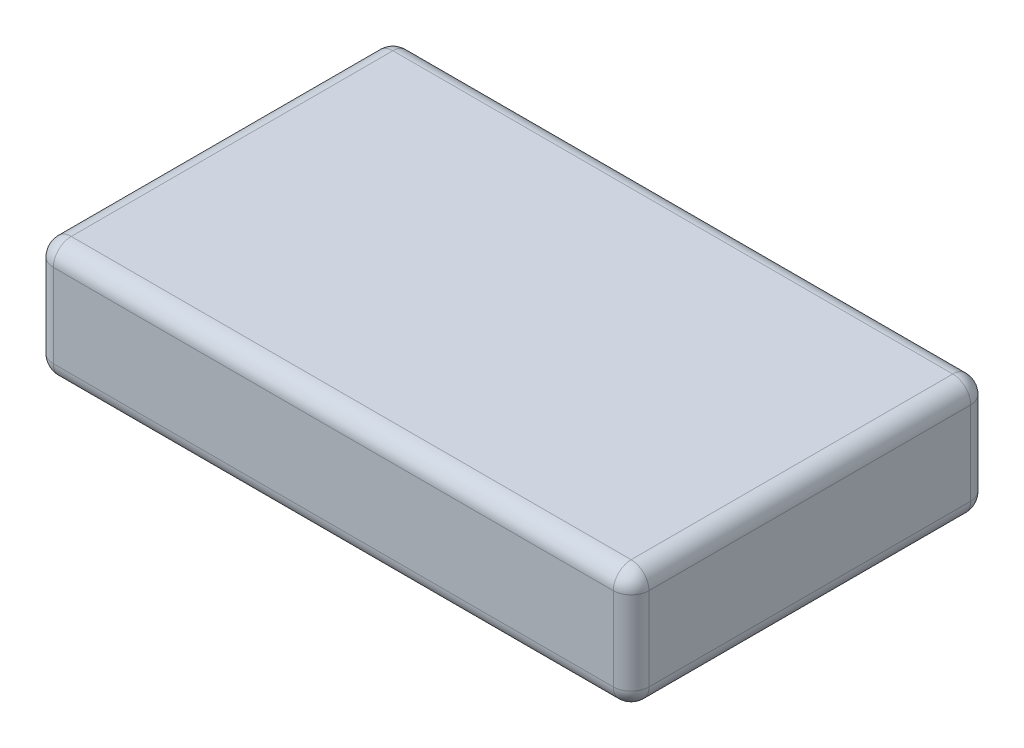
ISO-10303-21;
HEADER;
FILE_DESCRIPTION(('STEP AP214'),'2;1');
FILE_NAME('part.step','',(''),(''),'','','');
FILE_SCHEMA(('AUTOMOTIVE_DESIGN { 1 0 10303 214 1 1 1 1 }'));
ENDSEC;
DATA;
#1=APPLICATION_CONTEXT('core data for automotive mechanical design processes');
#2=APPLICATION_PROTOCOL_DEFINITION('international standard','automotive_design',2000,#1);
#3=PRODUCT_CONTEXT('',#1,'mechanical');
#4=PRODUCT('Part','Part','',(#3));
#5=PRODUCT_RELATED_PRODUCT_CATEGORY('part','',(#4));
#6=PRODUCT_DEFINITION_FORMATION('','',#4);
#7=PRODUCT_DEFINITION_CONTEXT('part definition',#1,'design');
#8=PRODUCT_DEFINITION('design','',#6,#7);
#9=PRODUCT_DEFINITION_SHAPE('','',#8);
#10=(LENGTH_UNIT() NAMED_UNIT(*) SI_UNIT(.MILLI.,.METRE.));
#11=(NAMED_UNIT(*) PLANE_ANGLE_UNIT() SI_UNIT($,.RADIAN.));
#12=(NAMED_UNIT(*) SI_UNIT($,.STERADIAN.) SOLID_ANGLE_UNIT());
#13=UNCERTAINTY_MEASURE_WITH_UNIT(LENGTH_MEASURE(1.E-05),#10,'distance_accuracy_value','');
#14=(GEOMETRIC_REPRESENTATION_CONTEXT(3) GLOBAL_UNCERTAINTY_ASSIGNED_CONTEXT((#13)) GLOBAL_UNIT_ASSIGNED_CONTEXT((#10,
#11,#12)) REPRESENTATION_CONTEXT('',''));
#15=CARTESIAN_POINT('',(0.,0.,0.));
#16=DIRECTION('',(0.,0.,1.));
#17=DIRECTION('',(1.,0.,0.));
#18=AXIS2_PLACEMENT_3D('',#15,#16,#17);
#19=CARTESIAN_POINT('',(50.,20.,-30.));
#20=DIRECTION('',(-1.,0.,0.));
#21=DIRECTION('',(0.,0.,1.));
#22=AXIS2_PLACEMENT_3D('',#19,#20,#21);
#23=PLANE('',#22);
#24=DIRECTION('',(0.,0.,-1.));
#25=VECTOR('',#24,1.);
#26=CARTESIAN_POINT('',(50.,17.,30.));
#27=LINE('',#26,#25);
#28=CARTESIAN_POINT('',(50.,17.,-27.));
#29=VERTEX_POINT('',#28);
#30=CARTESIAN_POINT('',(50.,17.,27.));
#31=VERTEX_POINT('',#30);
#32=EDGE_CURVE('E226',#29,#31,#27,.F.);
#33=ORIENTED_EDGE('',*,*,#32,.T.);
#34=DIRECTION('',(0.,-1.,0.));
#35=VECTOR('',#34,1.);
#36=CARTESIAN_POINT('',(50.,20.,27.));
#37=LINE('',#36,#35);
#38=CARTESIAN_POINT('',(50.,3.,27.));
#39=VERTEX_POINT('',#38);
#40=EDGE_CURVE('E225',#31,#39,#37,.T.);
#41=ORIENTED_EDGE('',*,*,#40,.T.);
#42=DIRECTION('',(0.,0.,-1.));
#43=VECTOR('',#42,1.);
#44=CARTESIAN_POINT('',(50.,3.,-30.));
#45=LINE('',#44,#43);
#46=CARTESIAN_POINT('',(50.,3.,-27.));
#47=VERTEX_POINT('',#46);
#48=EDGE_CURVE('E221',#39,#47,#45,.T.);
#49=ORIENTED_EDGE('',*,*,#48,.T.);
#50=DIRECTION('',(0.,-1.,0.));
#51=VECTOR('',#50,1.);
#52=CARTESIAN_POINT('',(50.,20.,-27.));
#53=LINE('',#52,#51);
#54=EDGE_CURVE('E230',#47,#29,#53,.F.);
#55=ORIENTED_EDGE('',*,*,#54,.T.);
#56=EDGE_LOOP('',(#33,#41,#49,#55));
#57=FACE_BOUND('',#56,.T.);
#58=ADVANCED_FACE('F35',(#57),#23,.F.);
#59=CARTESIAN_POINT('',(-50.,20.,-30.));
#60=DIRECTION('',(0.,0.,1.));
#61=DIRECTION('',(1.,0.,0.));
#62=AXIS2_PLACEMENT_3D('',#59,#60,#61);
#63=PLANE('',#62);
#64=DIRECTION('',(-1.,0.,0.));
#65=VECTOR('',#64,1.);
#66=CARTESIAN_POINT('',(50.,17.,-30.));
#67=LINE('',#66,#65);
#68=CARTESIAN_POINT('',(-47.,17.,-30.));
#69=VERTEX_POINT('',#68);
#70=CARTESIAN_POINT('',(47.,17.,-30.));
#71=VERTEX_POINT('',#70);
#72=EDGE_CURVE('E262',#69,#71,#67,.F.);
#73=ORIENTED_EDGE('',*,*,#72,.T.);
#74=DIRECTION('',(0.,-1.,0.));
#75=VECTOR('',#74,1.);
#76=CARTESIAN_POINT('',(47.,20.,-30.));
#77=LINE('',#76,#75);
#78=CARTESIAN_POINT('',(47.,3.,-30.));
#79=VERTEX_POINT('',#78);
#80=EDGE_CURVE('E256',#71,#79,#77,.T.);
#81=ORIENTED_EDGE('',*,*,#80,.T.);
#82=DIRECTION('',(-1.,0.,0.));
#83=VECTOR('',#82,1.);
#84=CARTESIAN_POINT('',(-50.,3.,-30.));
#85=LINE('',#84,#83);
#86=CARTESIAN_POINT('',(-47.,3.,-30.));
#87=VERTEX_POINT('',#86);
#88=EDGE_CURVE('E269',#79,#87,#85,.T.);
#89=ORIENTED_EDGE('',*,*,#88,.T.);
#90=DIRECTION('',(0.,-1.,0.));
#91=VECTOR('',#90,1.);
#92=CARTESIAN_POINT('',(-47.,20.,-30.));
#93=LINE('',#92,#91);
#94=EDGE_CURVE('E267',#87,#69,#93,.F.);
#95=ORIENTED_EDGE('',*,*,#94,.T.);
#96=EDGE_LOOP('',(#73,#81,#89,#95));
#97=FACE_BOUND('',#96,.T.);
#98=ADVANCED_FACE('F265',(#97),#63,.F.);
#99=CARTESIAN_POINT('',(-50.,20.,-30.));
#100=DIRECTION('',(1.,0.,0.));
#101=DIRECTION('',(0.,0.,-1.));
#102=AXIS2_PLACEMENT_3D('',#99,#100,#101);
#103=PLANE('',#102);
#104=DIRECTION('',(0.,0.,1.));
#105=VECTOR('',#104,1.);
#106=CARTESIAN_POINT('',(-50.,17.,-30.));
#107=LINE('',#106,#105);
#108=CARTESIAN_POINT('',(-50.,17.,27.));
#109=VERTEX_POINT('',#108);
#110=CARTESIAN_POINT('',(-50.,17.,-27.));
#111=VERTEX_POINT('',#110);
#112=EDGE_CURVE('E44',#109,#111,#107,.F.);
#113=ORIENTED_EDGE('',*,*,#112,.T.);
#114=DIRECTION('',(0.,-1.,0.));
#115=VECTOR('',#114,1.);
#116=CARTESIAN_POINT('',(-50.,20.,-27.));
#117=LINE('',#116,#115);
#118=CARTESIAN_POINT('',(-50.,3.,-27.));
#119=VERTEX_POINT('',#118);
#120=EDGE_CURVE('E11',#111,#119,#117,.T.);
#121=ORIENTED_EDGE('',*,*,#120,.T.);
#122=DIRECTION('',(0.,0.,1.));
#123=VECTOR('',#122,1.);
#124=CARTESIAN_POINT('',(-50.,3.,-30.));
#125=LINE('',#124,#123);
#126=CARTESIAN_POINT('',(-50.,3.,27.));
#127=VERTEX_POINT('',#126);
#128=EDGE_CURVE('E235',#119,#127,#125,.T.);
#129=ORIENTED_EDGE('',*,*,#128,.T.);
#130=DIRECTION('',(0.,-1.,0.));
#131=VECTOR('',#130,1.);
#132=CARTESIAN_POINT('',(-50.,20.,27.));
#133=LINE('',#132,#131);
#134=EDGE_CURVE('E228',#127,#109,#133,.F.);
#135=ORIENTED_EDGE('',*,*,#134,.T.);
#136=EDGE_LOOP('',(#113,#121,#129,#135));
#137=FACE_BOUND('',#136,.T.);
#138=ADVANCED_FACE('F317',(#137),#103,.F.);
#139=CARTESIAN_POINT('',(-50.,20.,30.));
#140=DIRECTION('',(0.,0.,-1.));
#141=DIRECTION('',(-1.,0.,0.));
#142=AXIS2_PLACEMENT_3D('',#139,#140,#141);
#143=PLANE('',#142);
#144=DIRECTION('',(0.,-1.,0.));
#145=VECTOR('',#144,1.);
#146=CARTESIAN_POINT('',(-47.,20.,30.));
#147=LINE('',#146,#145);
#148=CARTESIAN_POINT('',(-47.,17.,30.));
#149=VERTEX_POINT('',#148);
#150=CARTESIAN_POINT('',(-47.,3.,30.));
#151=VERTEX_POINT('',#150);
#152=EDGE_CURVE('E261',#149,#151,#147,.T.);
#153=ORIENTED_EDGE('',*,*,#152,.T.);
#154=DIRECTION('',(1.,0.,0.));
#155=VECTOR('',#154,1.);
#156=CARTESIAN_POINT('',(-50.,3.,30.));
#157=LINE('',#156,#155);
#158=CARTESIAN_POINT('',(47.,3.,30.));
#159=VERTEX_POINT('',#158);
#160=EDGE_CURVE('E279',#151,#159,#157,.T.);
#161=ORIENTED_EDGE('',*,*,#160,.T.);
#162=DIRECTION('',(0.,-1.,0.));
#163=VECTOR('',#162,1.);
#164=CARTESIAN_POINT('',(47.,20.,30.));
#165=LINE('',#164,#163);
#166=CARTESIAN_POINT('',(47.,17.,30.));
#167=VERTEX_POINT('',#166);
#168=EDGE_CURVE('E277',#159,#167,#165,.F.);
#169=ORIENTED_EDGE('',*,*,#168,.T.);
#170=DIRECTION('',(1.,0.,0.));
#171=VECTOR('',#170,1.);
#172=CARTESIAN_POINT('',(-50.,17.,30.));
#173=LINE('',#172,#171);
#174=EDGE_CURVE('E275',#167,#149,#173,.F.);
#175=ORIENTED_EDGE('',*,*,#174,.T.);
#176=EDGE_LOOP('',(#153,#161,#169,#175));
#177=FACE_BOUND('',#176,.T.);
#178=ADVANCED_FACE('F299',(#177),#143,.F.);
#179=CARTESIAN_POINT('',(0.,20.,0.));
#180=DIRECTION('',(0.,1.,0.));
#181=DIRECTION('',(0.,0.,1.));
#182=AXIS2_PLACEMENT_3D('',#179,#180,#181);
#183=PLANE('',#182);
#184=DIRECTION('',(0.,0.,-1.));
#185=VECTOR('',#184,1.);
#186=CARTESIAN_POINT('',(47.,20.,-30.));
#187=LINE('',#186,#185);
#188=CARTESIAN_POINT('',(47.,20.,27.));
#189=VERTEX_POINT('',#188);
#190=CARTESIAN_POINT('',(47.,20.,-27.));
#191=VERTEX_POINT('',#190);
#192=EDGE_CURVE('E136',#189,#191,#187,.T.);
#193=ORIENTED_EDGE('',*,*,#192,.T.);
#194=DIRECTION('',(-1.,0.,0.));
#195=VECTOR('',#194,1.);
#196=CARTESIAN_POINT('',(-50.,20.,-27.));
#197=LINE('',#196,#195);
#198=CARTESIAN_POINT('',(-47.,20.,-27.));
#199=VERTEX_POINT('',#198);
#200=EDGE_CURVE('E133',#191,#199,#197,.T.);
#201=ORIENTED_EDGE('',*,*,#200,.T.);
#202=DIRECTION('',(0.,0.,1.));
#203=VECTOR('',#202,1.);
#204=CARTESIAN_POINT('',(-47.,20.,30.));
#205=LINE('',#204,#203);
#206=CARTESIAN_POINT('',(-47.,20.,27.));
#207=VERTEX_POINT('',#206);
#208=EDGE_CURVE('E127',#199,#207,#205,.T.);
#209=ORIENTED_EDGE('',*,*,#208,.T.);
#210=DIRECTION('',(1.,0.,0.));
#211=VECTOR('',#210,1.);
#212=CARTESIAN_POINT('',(50.,20.,27.));
#213=LINE('',#212,#211);
#214=EDGE_CURVE('E130',#207,#189,#213,.T.);
#215=ORIENTED_EDGE('',*,*,#214,.T.);
#216=EDGE_LOOP('',(#193,#201,#209,#215));
#217=FACE_BOUND('',#216,.T.);
#218=ADVANCED_FACE('F129',(#217),#183,.T.);
#219=CARTESIAN_POINT('',(0.,0.,0.));
#220=DIRECTION('',(0.,1.,0.));
#221=DIRECTION('',(0.,0.,1.));
#222=AXIS2_PLACEMENT_3D('',#219,#220,#221);
#223=PLANE('',#222);
#224=DIRECTION('',(0.,0.,-1.));
#225=VECTOR('',#224,1.);
#226=CARTESIAN_POINT('',(47.,0.,0.));
#227=LINE('',#226,#225);
#228=CARTESIAN_POINT('',(47.,0.,-27.));
#229=VERTEX_POINT('',#228);
#230=CARTESIAN_POINT('',(47.,0.,27.));
#231=VERTEX_POINT('',#230);
#232=EDGE_CURVE('E219',#229,#231,#227,.F.);
#233=ORIENTED_EDGE('',*,*,#232,.T.);
#234=DIRECTION('',(1.,0.,0.));
#235=VECTOR('',#234,1.);
#236=CARTESIAN_POINT('',(0.,0.,27.));
#237=LINE('',#236,#235);
#238=CARTESIAN_POINT('',(-47.,0.,27.));
#239=VERTEX_POINT('',#238);
#240=EDGE_CURVE('E286',#231,#239,#237,.F.);
#241=ORIENTED_EDGE('',*,*,#240,.T.);
#242=DIRECTION('',(0.,0.,1.));
#243=VECTOR('',#242,1.);
#244=CARTESIAN_POINT('',(-47.,0.,0.));
#245=LINE('',#244,#243);
#246=CARTESIAN_POINT('',(-47.,0.,-27.));
#247=VERTEX_POINT('',#246);
#248=EDGE_CURVE('E284',#239,#247,#245,.F.);
#249=ORIENTED_EDGE('',*,*,#248,.T.);
#250=DIRECTION('',(-1.,0.,0.));
#251=VECTOR('',#250,1.);
#252=CARTESIAN_POINT('',(0.,0.,-27.));
#253=LINE('',#252,#251);
#254=EDGE_CURVE('E282',#247,#229,#253,.F.);
#255=ORIENTED_EDGE('',*,*,#254,.T.);
#256=EDGE_LOOP('',(#233,#241,#249,#255));
#257=FACE_BOUND('',#256,.T.);
#258=ADVANCED_FACE('F302',(#257),#223,.F.);
#259=CARTESIAN_POINT('',(-50.,3.,27.));
#260=DIRECTION('',(1.,0.,0.));
#261=DIRECTION('',(0.,0.,-1.));
#262=AXIS2_PLACEMENT_3D('',#259,#260,#261);
#263=CYLINDRICAL_SURFACE('',#262,3.);
#264=CARTESIAN_POINT('',(47.,3.,27.));
#265=DIRECTION('',(1.,0.,0.));
#266=DIRECTION('',(0.,0.,-1.));
#267=AXIS2_PLACEMENT_3D('',#264,#265,#266);
#268=CIRCLE('',#267,3.);
#269=EDGE_CURVE('E39',#159,#231,#268,.T.);
#270=ORIENTED_EDGE('',*,*,#269,.F.);
#271=ORIENTED_EDGE('',*,*,#160,.F.);
#272=CARTESIAN_POINT('',(-47.,3.,27.));
#273=DIRECTION('',(-1.,0.,0.));
#274=DIRECTION('',(0.,0.,1.));
#275=AXIS2_PLACEMENT_3D('',#272,#273,#274);
#276=CIRCLE('',#275,3.);
#277=EDGE_CURVE('E199',#239,#151,#276,.T.);
#278=ORIENTED_EDGE('',*,*,#277,.F.);
#279=ORIENTED_EDGE('',*,*,#240,.F.);
#280=EDGE_LOOP('',(#270,#271,#278,#279));
#281=FACE_BOUND('',#280,.T.);
#282=ADVANCED_FACE('F37',(#281),#263,.T.);
#283=CARTESIAN_POINT('',(47.,3.,27.));
#284=DIRECTION('',(0.,-1.,0.));
#285=DIRECTION('',(0.,0.,-1.));
#286=AXIS2_PLACEMENT_3D('',#283,#284,#285);
#287=SPHERICAL_SURFACE('',#286,3.);
#288=CARTESIAN_POINT('',(47.,3.,27.));
#289=DIRECTION('',(0.,-1.,0.));
#290=DIRECTION('',(0.,0.,-1.));
#291=AXIS2_PLACEMENT_3D('',#288,#289,#290);
#292=CIRCLE('',#291,3.);
#293=EDGE_CURVE('E194',#159,#39,#292,.F.);
#294=ORIENTED_EDGE('',*,*,#293,.F.);
#295=ORIENTED_EDGE('',*,*,#269,.T.);
#296=CARTESIAN_POINT('',(47.,3.,27.));
#297=DIRECTION('',(0.,0.,1.));
#298=DIRECTION('',(1.,0.,0.));
#299=AXIS2_PLACEMENT_3D('',#296,#297,#298);
#300=CIRCLE('',#299,3.);
#301=EDGE_CURVE('E197',#39,#231,#300,.F.);
#302=ORIENTED_EDGE('',*,*,#301,.F.);
#303=EDGE_LOOP('',(#294,#295,#302));
#304=FACE_BOUND('',#303,.T.);
#305=ADVANCED_FACE('F210',(#304),#287,.T.);
#306=CARTESIAN_POINT('',(-47.,3.,27.));
#307=DIRECTION('',(0.,0.,1.));
#308=DIRECTION('',(0.,-1.,0.));
#309=AXIS2_PLACEMENT_3D('',#306,#307,#308);
#310=SPHERICAL_SURFACE('',#309,3.);
#311=CARTESIAN_POINT('',(-47.,3.,27.));
#312=DIRECTION('',(0.,0.,1.));
#313=DIRECTION('',(1.,0.,0.));
#314=AXIS2_PLACEMENT_3D('',#311,#312,#313);
#315=CIRCLE('',#314,3.);
#316=EDGE_CURVE('E188',#239,#127,#315,.F.);
#317=ORIENTED_EDGE('',*,*,#316,.F.);
#318=ORIENTED_EDGE('',*,*,#277,.T.);
#319=CARTESIAN_POINT('',(-47.,3.,27.));
#320=DIRECTION('',(0.,-1.,0.));
#321=DIRECTION('',(0.,0.,-1.));
#322=AXIS2_PLACEMENT_3D('',#319,#320,#321);
#323=CIRCLE('',#322,3.);
#324=EDGE_CURVE('E191',#127,#151,#323,.F.);
#325=ORIENTED_EDGE('',*,*,#324,.F.);
#326=EDGE_LOOP('',(#317,#318,#325));
#327=FACE_BOUND('',#326,.T.);
#328=ADVANCED_FACE('F321',(#327),#310,.T.);
#329=CARTESIAN_POINT('',(47.,3.,-30.));
#330=DIRECTION('',(0.,0.,-1.));
#331=DIRECTION('',(-1.,0.,0.));
#332=AXIS2_PLACEMENT_3D('',#329,#330,#331);
#333=CYLINDRICAL_SURFACE('',#332,3.);
#334=ORIENTED_EDGE('',*,*,#301,.T.);
#335=ORIENTED_EDGE('',*,*,#232,.F.);
#336=CARTESIAN_POINT('',(47.,3.,-27.));
#337=DIRECTION('',(0.,0.,-1.));
#338=DIRECTION('',(-1.,0.,0.));
#339=AXIS2_PLACEMENT_3D('',#336,#337,#338);
#340=CIRCLE('',#339,3.);
#341=EDGE_CURVE('E182',#47,#229,#340,.T.);
#342=ORIENTED_EDGE('',*,*,#341,.F.);
#343=ORIENTED_EDGE('',*,*,#48,.F.);
#344=EDGE_LOOP('',(#334,#335,#342,#343));
#345=FACE_BOUND('',#344,.T.);
#346=ADVANCED_FACE('F217',(#345),#333,.T.);
#347=CARTESIAN_POINT('',(47.,20.,27.));
#348=DIRECTION('',(0.,-1.,0.));
#349=DIRECTION('',(0.,0.,-1.));
#350=AXIS2_PLACEMENT_3D('',#347,#348,#349);
#351=CYLINDRICAL_SURFACE('',#350,3.);
#352=ORIENTED_EDGE('',*,*,#293,.T.);
#353=ORIENTED_EDGE('',*,*,#40,.F.);
#354=CARTESIAN_POINT('',(47.,17.,27.));
#355=DIRECTION('',(0.,1.,0.));
#356=DIRECTION('',(0.,0.,1.));
#357=AXIS2_PLACEMENT_3D('',#354,#355,#356);
#358=CIRCLE('',#357,3.);
#359=EDGE_CURVE('E179',#167,#31,#358,.T.);
#360=ORIENTED_EDGE('',*,*,#359,.F.);
#361=ORIENTED_EDGE('',*,*,#168,.F.);
#362=EDGE_LOOP('',(#352,#353,#360,#361));
#363=FACE_BOUND('',#362,.T.);
#364=ADVANCED_FACE('F297',(#363),#351,.T.);
#365=CARTESIAN_POINT('',(0.,17.,27.));
#366=DIRECTION('',(-1.,0.,0.));
#367=DIRECTION('',(0.,0.,1.));
#368=AXIS2_PLACEMENT_3D('',#365,#366,#367);
#369=CYLINDRICAL_SURFACE('',#368,3.);
#370=CARTESIAN_POINT('',(-47.,17.,27.));
#371=DIRECTION('',(-1.,0.,0.));
#372=DIRECTION('',(0.,0.,1.));
#373=AXIS2_PLACEMENT_3D('',#370,#371,#372);
#374=CIRCLE('',#373,3.);
#375=EDGE_CURVE('E143',#149,#207,#374,.T.);
#376=ORIENTED_EDGE('',*,*,#375,.F.);
#377=ORIENTED_EDGE('',*,*,#174,.F.);
#378=CARTESIAN_POINT('',(47.,17.,27.));
#379=DIRECTION('',(1.,0.,0.));
#380=DIRECTION('',(0.,0.,-1.));
#381=AXIS2_PLACEMENT_3D('',#378,#379,#380);
#382=CIRCLE('',#381,3.);
#383=EDGE_CURVE('E146',#189,#167,#382,.T.);
#384=ORIENTED_EDGE('',*,*,#383,.F.);
#385=ORIENTED_EDGE('',*,*,#214,.F.);
#386=EDGE_LOOP('',(#376,#377,#384,#385));
#387=FACE_BOUND('',#386,.T.);
#388=ADVANCED_FACE('F141',(#387),#369,.T.);
#389=CARTESIAN_POINT('',(-47.,20.,27.));
#390=DIRECTION('',(0.,-1.,0.));
#391=DIRECTION('',(0.,0.,-1.));
#392=AXIS2_PLACEMENT_3D('',#389,#390,#391);
#393=CYLINDRICAL_SURFACE('',#392,3.);
#394=ORIENTED_EDGE('',*,*,#324,.T.);
#395=ORIENTED_EDGE('',*,*,#152,.F.);
#396=CARTESIAN_POINT('',(-47.,17.,27.));
#397=DIRECTION('',(0.,1.,0.));
#398=DIRECTION('',(0.,0.,1.));
#399=AXIS2_PLACEMENT_3D('',#396,#397,#398);
#400=CIRCLE('',#399,3.);
#401=EDGE_CURVE('E155',#109,#149,#400,.T.);
#402=ORIENTED_EDGE('',*,*,#401,.F.);
#403=ORIENTED_EDGE('',*,*,#134,.F.);
#404=EDGE_LOOP('',(#394,#395,#402,#403));
#405=FACE_BOUND('',#404,.T.);
#406=ADVANCED_FACE('F320',(#405),#393,.T.);
#407=CARTESIAN_POINT('',(-47.,3.,-30.));
#408=DIRECTION('',(0.,0.,1.));
#409=DIRECTION('',(1.,0.,0.));
#410=AXIS2_PLACEMENT_3D('',#407,#408,#409);
#411=CYLINDRICAL_SURFACE('',#410,3.);
#412=ORIENTED_EDGE('',*,*,#316,.T.);
#413=ORIENTED_EDGE('',*,*,#128,.F.);
#414=CARTESIAN_POINT('',(-47.,3.,-27.));
#415=DIRECTION('',(0.,0.,-1.));
#416=DIRECTION('',(-1.,0.,0.));
#417=AXIS2_PLACEMENT_3D('',#414,#415,#416);
#418=CIRCLE('',#417,3.);
#419=EDGE_CURVE('E174',#247,#119,#418,.T.);
#420=ORIENTED_EDGE('',*,*,#419,.F.);
#421=ORIENTED_EDGE('',*,*,#248,.F.);
#422=EDGE_LOOP('',(#412,#413,#420,#421));
#423=FACE_BOUND('',#422,.T.);
#424=ADVANCED_FACE('F310',(#423),#411,.T.);
#425=CARTESIAN_POINT('',(-50.,3.,-27.));
#426=DIRECTION('',(-1.,0.,0.));
#427=DIRECTION('',(0.,0.,1.));
#428=AXIS2_PLACEMENT_3D('',#425,#426,#427);
#429=CYLINDRICAL_SURFACE('',#428,3.);
#430=CARTESIAN_POINT('',(47.,3.,-27.));
#431=DIRECTION('',(1.,0.,0.));
#432=DIRECTION('',(0.,0.,-1.));
#433=AXIS2_PLACEMENT_3D('',#430,#431,#432);
#434=CIRCLE('',#433,3.);
#435=EDGE_CURVE('E185',#229,#79,#434,.T.);
#436=ORIENTED_EDGE('',*,*,#435,.F.);
#437=ORIENTED_EDGE('',*,*,#254,.F.);
#438=CARTESIAN_POINT('',(-47.,3.,-27.));
#439=DIRECTION('',(-1.,0.,0.));
#440=DIRECTION('',(0.,0.,1.));
#441=AXIS2_PLACEMENT_3D('',#438,#439,#440);
#442=CIRCLE('',#441,3.);
#443=EDGE_CURVE('E171',#87,#247,#442,.T.);
#444=ORIENTED_EDGE('',*,*,#443,.F.);
#445=ORIENTED_EDGE('',*,*,#88,.F.);
#446=EDGE_LOOP('',(#436,#437,#444,#445));
#447=FACE_BOUND('',#446,.T.);
#448=ADVANCED_FACE('F307',(#447),#429,.T.);
#449=CARTESIAN_POINT('',(47.,3.,-27.));
#450=DIRECTION('',(0.,-1.,0.));
#451=DIRECTION('',(0.,0.,-1.));
#452=AXIS2_PLACEMENT_3D('',#449,#450,#451);
#453=SPHERICAL_SURFACE('',#452,3.);
#454=ORIENTED_EDGE('',*,*,#341,.T.);
#455=ORIENTED_EDGE('',*,*,#435,.T.);
#456=CARTESIAN_POINT('',(47.,3.,-27.));
#457=DIRECTION('',(0.,-1.,0.));
#458=DIRECTION('',(0.,0.,-1.));
#459=AXIS2_PLACEMENT_3D('',#456,#457,#458);
#460=CIRCLE('',#459,3.);
#461=EDGE_CURVE('E162',#47,#79,#460,.F.);
#462=ORIENTED_EDGE('',*,*,#461,.F.);
#463=EDGE_LOOP('',(#454,#455,#462));
#464=FACE_BOUND('',#463,.T.);
#465=ADVANCED_FACE('F359',(#464),#453,.T.);
#466=CARTESIAN_POINT('',(47.,17.,27.));
#467=DIRECTION('',(0.,0.,1.));
#468=DIRECTION('',(1.,0.,0.));
#469=AXIS2_PLACEMENT_3D('',#466,#467,#468);
#470=SPHERICAL_SURFACE('',#469,3.);
#471=ORIENTED_EDGE('',*,*,#383,.T.);
#472=ORIENTED_EDGE('',*,*,#359,.T.);
#473=CARTESIAN_POINT('',(47.,17.,27.));
#474=DIRECTION('',(0.,0.,1.));
#475=DIRECTION('',(1.,0.,0.));
#476=AXIS2_PLACEMENT_3D('',#473,#474,#475);
#477=CIRCLE('',#476,3.);
#478=EDGE_CURVE('E158',#189,#31,#477,.F.);
#479=ORIENTED_EDGE('',*,*,#478,.F.);
#480=EDGE_LOOP('',(#471,#472,#479));
#481=FACE_BOUND('',#480,.T.);
#482=ADVANCED_FACE('F294',(#481),#470,.T.);
#483=CARTESIAN_POINT('',(-47.,17.,27.));
#484=DIRECTION('',(0.,0.,1.));
#485=DIRECTION('',(1.,0.,0.));
#486=AXIS2_PLACEMENT_3D('',#483,#484,#485);
#487=SPHERICAL_SURFACE('',#486,3.);
#488=ORIENTED_EDGE('',*,*,#401,.T.);
#489=ORIENTED_EDGE('',*,*,#375,.T.);
#490=CARTESIAN_POINT('',(-47.,17.,27.));
#491=DIRECTION('',(0.,0.,1.));
#492=DIRECTION('',(1.,0.,0.));
#493=AXIS2_PLACEMENT_3D('',#490,#491,#492);
#494=CIRCLE('',#493,3.);
#495=EDGE_CURVE('E152',#109,#207,#494,.F.);
#496=ORIENTED_EDGE('',*,*,#495,.F.);
#497=EDGE_LOOP('',(#488,#489,#496));
#498=FACE_BOUND('',#497,.T.);
#499=ADVANCED_FACE('F151',(#498),#487,.T.);
#500=CARTESIAN_POINT('',(-47.,3.,-27.));
#501=DIRECTION('',(0.,-1.,0.));
#502=DIRECTION('',(0.,0.,-1.));
#503=AXIS2_PLACEMENT_3D('',#500,#501,#502);
#504=SPHERICAL_SURFACE('',#503,3.);
#505=ORIENTED_EDGE('',*,*,#443,.T.);
#506=ORIENTED_EDGE('',*,*,#419,.T.);
#507=CARTESIAN_POINT('',(-47.,3.,-27.));
#508=DIRECTION('',(0.,-1.,0.));
#509=DIRECTION('',(0.,0.,-1.));
#510=AXIS2_PLACEMENT_3D('',#507,#508,#509);
#511=CIRCLE('',#510,3.);
#512=EDGE_CURVE('E159',#87,#119,#511,.F.);
#513=ORIENTED_EDGE('',*,*,#512,.F.);
#514=EDGE_LOOP('',(#505,#506,#513));
#515=FACE_BOUND('',#514,.T.);
#516=ADVANCED_FACE('F312',(#515),#504,.T.);
#517=CARTESIAN_POINT('',(47.,20.,-27.));
#518=DIRECTION('',(0.,-1.,0.));
#519=DIRECTION('',(0.,0.,-1.));
#520=AXIS2_PLACEMENT_3D('',#517,#518,#519);
#521=CYLINDRICAL_SURFACE('',#520,3.);
#522=ORIENTED_EDGE('',*,*,#461,.T.);
#523=ORIENTED_EDGE('',*,*,#80,.F.);
#524=CARTESIAN_POINT('',(47.,17.,-27.));
#525=DIRECTION('',(0.,1.,0.));
#526=DIRECTION('',(0.,0.,1.));
#527=AXIS2_PLACEMENT_3D('',#524,#525,#526);
#528=CIRCLE('',#527,3.);
#529=EDGE_CURVE('E165',#29,#71,#528,.T.);
#530=ORIENTED_EDGE('',*,*,#529,.F.);
#531=ORIENTED_EDGE('',*,*,#54,.F.);
#532=EDGE_LOOP('',(#522,#523,#530,#531));
#533=FACE_BOUND('',#532,.T.);
#534=ADVANCED_FACE('F258',(#533),#521,.T.);
#535=CARTESIAN_POINT('',(47.,17.,0.));
#536=DIRECTION('',(0.,0.,1.));
#537=DIRECTION('',(1.,0.,0.));
#538=AXIS2_PLACEMENT_3D('',#535,#536,#537);
#539=CYLINDRICAL_SURFACE('',#538,3.);
#540=ORIENTED_EDGE('',*,*,#478,.T.);
#541=ORIENTED_EDGE('',*,*,#32,.F.);
#542=CARTESIAN_POINT('',(47.,17.,-27.));
#543=DIRECTION('',(0.,0.,-1.));
#544=DIRECTION('',(-1.,0.,0.));
#545=AXIS2_PLACEMENT_3D('',#542,#543,#544);
#546=CIRCLE('',#545,3.);
#547=EDGE_CURVE('E245',#191,#29,#546,.T.);
#548=ORIENTED_EDGE('',*,*,#547,.F.);
#549=ORIENTED_EDGE('',*,*,#192,.F.);
#550=EDGE_LOOP('',(#540,#541,#548,#549));
#551=FACE_BOUND('',#550,.T.);
#552=ADVANCED_FACE('F291',(#551),#539,.T.);
#553=CARTESIAN_POINT('',(-47.,17.,0.));
#554=DIRECTION('',(0.,0.,-1.));
#555=DIRECTION('',(-1.,0.,0.));
#556=AXIS2_PLACEMENT_3D('',#553,#554,#555);
#557=CYLINDRICAL_SURFACE('',#556,3.);
#558=ORIENTED_EDGE('',*,*,#495,.T.);
#559=ORIENTED_EDGE('',*,*,#208,.F.);
#560=CARTESIAN_POINT('',(-47.,17.,-27.));
#561=DIRECTION('',(0.,0.,-1.));
#562=DIRECTION('',(-1.,0.,0.));
#563=AXIS2_PLACEMENT_3D('',#560,#561,#562);
#564=CIRCLE('',#563,3.);
#565=EDGE_CURVE('E243',#111,#199,#564,.T.);
#566=ORIENTED_EDGE('',*,*,#565,.F.);
#567=ORIENTED_EDGE('',*,*,#112,.F.);
#568=EDGE_LOOP('',(#558,#559,#566,#567));
#569=FACE_BOUND('',#568,.T.);
#570=ADVANCED_FACE('F157',(#569),#557,.T.);
#571=CARTESIAN_POINT('',(-47.,20.,-27.));
#572=DIRECTION('',(0.,-1.,0.));
#573=DIRECTION('',(0.,0.,-1.));
#574=AXIS2_PLACEMENT_3D('',#571,#572,#573);
#575=CYLINDRICAL_SURFACE('',#574,3.);
#576=ORIENTED_EDGE('',*,*,#512,.T.);
#577=ORIENTED_EDGE('',*,*,#120,.F.);
#578=CARTESIAN_POINT('',(-47.,17.,-27.));
#579=DIRECTION('',(0.,1.,0.));
#580=DIRECTION('',(0.,0.,1.));
#581=AXIS2_PLACEMENT_3D('',#578,#579,#580);
#582=CIRCLE('',#581,3.);
#583=EDGE_CURVE('E52',#69,#111,#582,.T.);
#584=ORIENTED_EDGE('',*,*,#583,.F.);
#585=ORIENTED_EDGE('',*,*,#94,.F.);
#586=EDGE_LOOP('',(#576,#577,#584,#585));
#587=FACE_BOUND('',#586,.T.);
#588=ADVANCED_FACE('F314',(#587),#575,.T.);
#589=CARTESIAN_POINT('',(47.,17.,-27.));
#590=DIRECTION('',(1.,0.,0.));
#591=DIRECTION('',(0.,0.,-1.));
#592=AXIS2_PLACEMENT_3D('',#589,#590,#591);
#593=SPHERICAL_SURFACE('',#592,3.);
#594=ORIENTED_EDGE('',*,*,#547,.T.);
#595=ORIENTED_EDGE('',*,*,#529,.T.);
#596=CARTESIAN_POINT('',(47.,17.,-27.));
#597=DIRECTION('',(1.,0.,0.));
#598=DIRECTION('',(0.,0.,-1.));
#599=AXIS2_PLACEMENT_3D('',#596,#597,#598);
#600=CIRCLE('',#599,3.);
#601=EDGE_CURVE('E240',#191,#71,#600,.F.);
#602=ORIENTED_EDGE('',*,*,#601,.F.);
#603=EDGE_LOOP('',(#594,#595,#602));
#604=FACE_BOUND('',#603,.T.);
#605=ADVANCED_FACE('F252',(#604),#593,.T.);
#606=CARTESIAN_POINT('',(-47.,17.,-27.));
#607=DIRECTION('',(-1.,0.,0.));
#608=DIRECTION('',(0.,0.,1.));
#609=AXIS2_PLACEMENT_3D('',#606,#607,#608);
#610=SPHERICAL_SURFACE('',#609,3.);
#611=ORIENTED_EDGE('',*,*,#583,.T.);
#612=ORIENTED_EDGE('',*,*,#565,.T.);
#613=CARTESIAN_POINT('',(-47.,17.,-27.));
#614=DIRECTION('',(-1.,0.,0.));
#615=DIRECTION('',(0.,0.,1.));
#616=AXIS2_PLACEMENT_3D('',#613,#614,#615);
#617=CIRCLE('',#616,3.);
#618=EDGE_CURVE('E238',#69,#199,#617,.F.);
#619=ORIENTED_EDGE('',*,*,#618,.F.);
#620=EDGE_LOOP('',(#611,#612,#619));
#621=FACE_BOUND('',#620,.T.);
#622=ADVANCED_FACE('F340',(#621),#610,.T.);
#623=CARTESIAN_POINT('',(0.,17.,-27.));
#624=DIRECTION('',(1.,0.,0.));
#625=DIRECTION('',(0.,0.,-1.));
#626=AXIS2_PLACEMENT_3D('',#623,#624,#625);
#627=CYLINDRICAL_SURFACE('',#626,3.);
#628=ORIENTED_EDGE('',*,*,#601,.T.);
#629=ORIENTED_EDGE('',*,*,#72,.F.);
#630=ORIENTED_EDGE('',*,*,#618,.T.);
#631=ORIENTED_EDGE('',*,*,#200,.F.);
#632=EDGE_LOOP('',(#628,#629,#630,#631));
#633=FACE_BOUND('',#632,.T.);
#634=ADVANCED_FACE('F337',(#633),#627,.T.);
#635=CLOSED_SHELL('',(#58,#98,#138,#178,#218,#258,#282,#305,#328,#346,#364,#388,#406,#424,#448,
#465,#482,#499,#516,#534,#552,#570,#588,#605,#622,#634));
#636=MANIFOLD_SOLID_BREP('B2',#635);
#637=ADVANCED_BREP_SHAPE_REPRESENTATION('',(#18,#636),#14);
#638=SHAPE_DEFINITION_REPRESENTATION(#9,#637);
ENDSEC;
END-ISO-10303-21;
